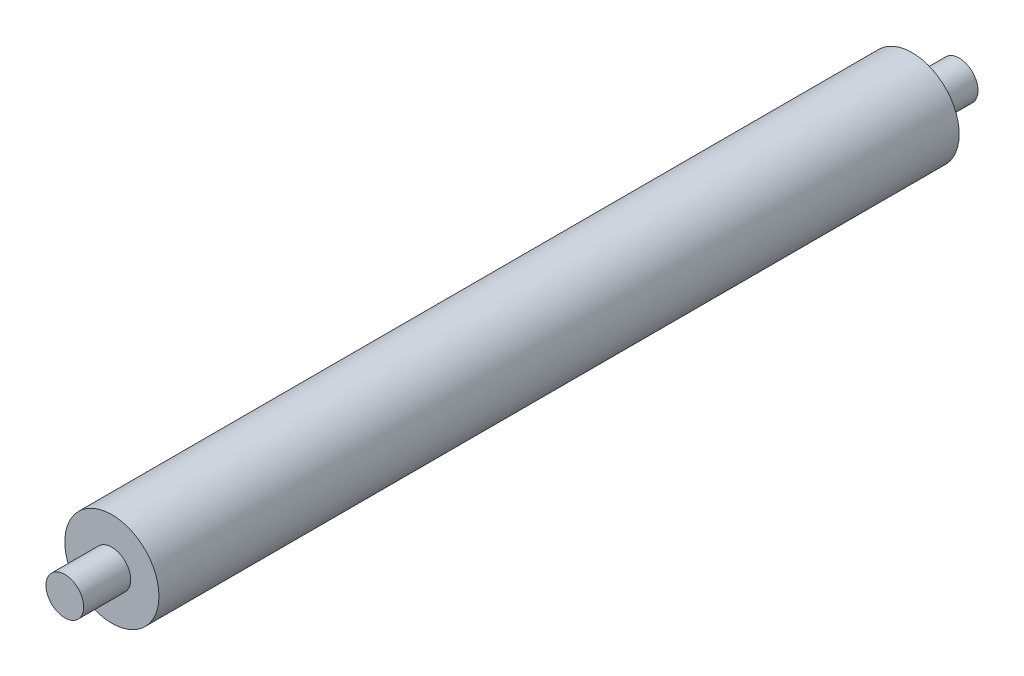
ISO-10303-21;
HEADER;
FILE_DESCRIPTION(('STEP AP214'),'2;1');
FILE_NAME('part.step','',(''),(''),'','','');
FILE_SCHEMA(('AUTOMOTIVE_DESIGN { 1 0 10303 214 1 1 1 1 }'));
ENDSEC;
DATA;
#1=APPLICATION_CONTEXT('core data for automotive mechanical design processes');
#2=APPLICATION_PROTOCOL_DEFINITION('international standard','automotive_design',2000,#1);
#3=PRODUCT_CONTEXT('',#1,'mechanical');
#4=PRODUCT('Part','Part','',(#3));
#5=PRODUCT_RELATED_PRODUCT_CATEGORY('part','',(#4));
#6=PRODUCT_DEFINITION_FORMATION('','',#4);
#7=PRODUCT_DEFINITION_CONTEXT('part definition',#1,'design');
#8=PRODUCT_DEFINITION('design','',#6,#7);
#9=PRODUCT_DEFINITION_SHAPE('','',#8);
#10=(LENGTH_UNIT() NAMED_UNIT(*) SI_UNIT(.MILLI.,.METRE.));
#11=(NAMED_UNIT(*) PLANE_ANGLE_UNIT() SI_UNIT($,.RADIAN.));
#12=(NAMED_UNIT(*) SI_UNIT($,.STERADIAN.) SOLID_ANGLE_UNIT());
#13=UNCERTAINTY_MEASURE_WITH_UNIT(LENGTH_MEASURE(1.E-05),#10,'distance_accuracy_value','');
#14=(GEOMETRIC_REPRESENTATION_CONTEXT(3) GLOBAL_UNCERTAINTY_ASSIGNED_CONTEXT((#13)) GLOBAL_UNIT_ASSIGNED_CONTEXT((#10,
#11,#12)) REPRESENTATION_CONTEXT('',''));
#15=CARTESIAN_POINT('',(0.,0.,0.));
#16=DIRECTION('',(0.,0.,1.));
#17=DIRECTION('',(1.,0.,0.));
#18=AXIS2_PLACEMENT_3D('',#15,#16,#17);
#19=CARTESIAN_POINT('',(0.,0.,47.5));
#20=DIRECTION('',(0.,0.,-1.));
#21=DIRECTION('',(-1.,0.,0.));
#22=AXIS2_PLACEMENT_3D('',#19,#20,#21);
#23=PLANE('',#22);
#24=CARTESIAN_POINT('',(0.,0.,47.5));
#25=DIRECTION('',(0.,0.,1.));
#26=DIRECTION('',(1.,0.,0.));
#27=AXIS2_PLACEMENT_3D('',#24,#25,#26);
#28=CIRCLE('',#27,2.);
#29=CARTESIAN_POINT('',(2.,0.,47.5));
#30=VERTEX_POINT('',#29);
#31=EDGE_CURVE('E10',#30,#30,#28,.T.);
#32=ORIENTED_EDGE('',*,*,#31,.T.);
#33=EDGE_LOOP('',(#32));
#34=FACE_BOUND('',#33,.T.);
#35=ADVANCED_FACE('F41',(#34),#23,.F.);
#36=CARTESIAN_POINT('',(0.,0.,47.5));
#37=DIRECTION('',(0.,0.,1.));
#38=DIRECTION('',(1.,0.,0.));
#39=AXIS2_PLACEMENT_3D('',#36,#37,#38);
#40=CYLINDRICAL_SURFACE('',#39,2.);
#41=ORIENTED_EDGE('',*,*,#31,.F.);
#42=EDGE_LOOP('',(#41));
#43=FACE_BOUND('',#42,.T.);
#44=CARTESIAN_POINT('',(0.,0.,42.5));
#45=DIRECTION('',(0.,0.,1.));
#46=DIRECTION('',(1.,0.,0.));
#47=AXIS2_PLACEMENT_3D('',#44,#45,#46);
#48=CIRCLE('',#47,2.);
#49=CARTESIAN_POINT('',(2.,0.,42.5));
#50=VERTEX_POINT('',#49);
#51=EDGE_CURVE('E48',#50,#50,#48,.T.);
#52=ORIENTED_EDGE('',*,*,#51,.T.);
#53=EDGE_LOOP('',(#52));
#54=FACE_BOUND('',#53,.T.);
#55=ADVANCED_FACE('F85',(#43,#54),#40,.T.);
#56=CARTESIAN_POINT('',(0.,2.,42.5));
#57=DIRECTION('',(0.,0.,-1.));
#58=DIRECTION('',(-1.,0.,0.));
#59=AXIS2_PLACEMENT_3D('',#56,#57,#58);
#60=PLANE('',#59);
#61=ORIENTED_EDGE('',*,*,#51,.F.);
#62=EDGE_LOOP('',(#61));
#63=FACE_BOUND('',#62,.T.);
#64=CARTESIAN_POINT('',(0.,0.,42.5));
#65=DIRECTION('',(0.,0.,1.));
#66=DIRECTION('',(1.,0.,0.));
#67=AXIS2_PLACEMENT_3D('',#64,#65,#66);
#68=CIRCLE('',#67,5.);
#69=CARTESIAN_POINT('',(5.,0.,42.5));
#70=VERTEX_POINT('',#69);
#71=EDGE_CURVE('E53',#70,#70,#68,.T.);
#72=ORIENTED_EDGE('',*,*,#71,.T.);
#73=EDGE_LOOP('',(#72));
#74=FACE_BOUND('',#73,.T.);
#75=ADVANCED_FACE('F89',(#63,#74),#60,.F.);
#76=CARTESIAN_POINT('',(0.,0.,47.5));
#77=DIRECTION('',(0.,0.,1.));
#78=DIRECTION('',(1.,0.,0.));
#79=AXIS2_PLACEMENT_3D('',#76,#77,#78);
#80=CYLINDRICAL_SURFACE('',#79,5.);
#81=ORIENTED_EDGE('',*,*,#71,.F.);
#82=EDGE_LOOP('',(#81));
#83=FACE_BOUND('',#82,.T.);
#84=CARTESIAN_POINT('',(0.,0.,-42.5));
#85=DIRECTION('',(0.,0.,1.));
#86=DIRECTION('',(1.,0.,0.));
#87=AXIS2_PLACEMENT_3D('',#84,#85,#86);
#88=CIRCLE('',#87,5.);
#89=CARTESIAN_POINT('',(5.,0.,-42.5));
#90=VERTEX_POINT('',#89);
#91=EDGE_CURVE('E58',#90,#90,#88,.T.);
#92=ORIENTED_EDGE('',*,*,#91,.T.);
#93=EDGE_LOOP('',(#92));
#94=FACE_BOUND('',#93,.T.);
#95=ADVANCED_FACE('F94',(#83,#94),#80,.T.);
#96=CARTESIAN_POINT('',(0.,5.,-42.5));
#97=DIRECTION('',(0.,0.,1.));
#98=DIRECTION('',(1.,0.,0.));
#99=AXIS2_PLACEMENT_3D('',#96,#97,#98);
#100=PLANE('',#99);
#101=ORIENTED_EDGE('',*,*,#91,.F.);
#102=EDGE_LOOP('',(#101));
#103=FACE_BOUND('',#102,.T.);
#104=CARTESIAN_POINT('',(0.,0.,-42.5));
#105=DIRECTION('',(0.,0.,1.));
#106=DIRECTION('',(1.,0.,0.));
#107=AXIS2_PLACEMENT_3D('',#104,#105,#106);
#108=CIRCLE('',#107,2.);
#109=CARTESIAN_POINT('',(2.,0.,-42.5));
#110=VERTEX_POINT('',#109);
#111=EDGE_CURVE('E64',#110,#110,#108,.T.);
#112=ORIENTED_EDGE('',*,*,#111,.T.);
#113=EDGE_LOOP('',(#112));
#114=FACE_BOUND('',#113,.T.);
#115=ADVANCED_FACE('F81',(#103,#114),#100,.F.);
#116=CARTESIAN_POINT('',(0.,0.,47.5));
#117=DIRECTION('',(0.,0.,1.));
#118=DIRECTION('',(1.,0.,0.));
#119=AXIS2_PLACEMENT_3D('',#116,#117,#118);
#120=CYLINDRICAL_SURFACE('',#119,2.);
#121=ORIENTED_EDGE('',*,*,#111,.F.);
#122=EDGE_LOOP('',(#121));
#123=FACE_BOUND('',#122,.T.);
#124=CARTESIAN_POINT('',(0.,0.,-47.5));
#125=DIRECTION('',(0.,0.,1.));
#126=DIRECTION('',(1.,0.,0.));
#127=AXIS2_PLACEMENT_3D('',#124,#125,#126);
#128=CIRCLE('',#127,2.);
#129=CARTESIAN_POINT('',(2.,0.,-47.5));
#130=VERTEX_POINT('',#129);
#131=EDGE_CURVE('E68',#130,#130,#128,.T.);
#132=ORIENTED_EDGE('',*,*,#131,.T.);
#133=EDGE_LOOP('',(#132));
#134=FACE_BOUND('',#133,.T.);
#135=ADVANCED_FACE('F73',(#123,#134),#120,.T.);
#136=CARTESIAN_POINT('',(0.,2.,-47.5));
#137=DIRECTION('',(0.,0.,1.));
#138=DIRECTION('',(1.,0.,0.));
#139=AXIS2_PLACEMENT_3D('',#136,#137,#138);
#140=PLANE('',#139);
#141=ORIENTED_EDGE('',*,*,#131,.F.);
#142=EDGE_LOOP('',(#141));
#143=FACE_BOUND('',#142,.T.);
#144=ADVANCED_FACE('F75',(#143),#140,.F.);
#145=CLOSED_SHELL('',(#35,#55,#75,#95,#115,#135,#144));
#146=MANIFOLD_SOLID_BREP('B2',#145);
#147=ADVANCED_BREP_SHAPE_REPRESENTATION('',(#18,#146),#14);
#148=SHAPE_DEFINITION_REPRESENTATION(#9,#147);
ENDSEC;
END-ISO-10303-21;
